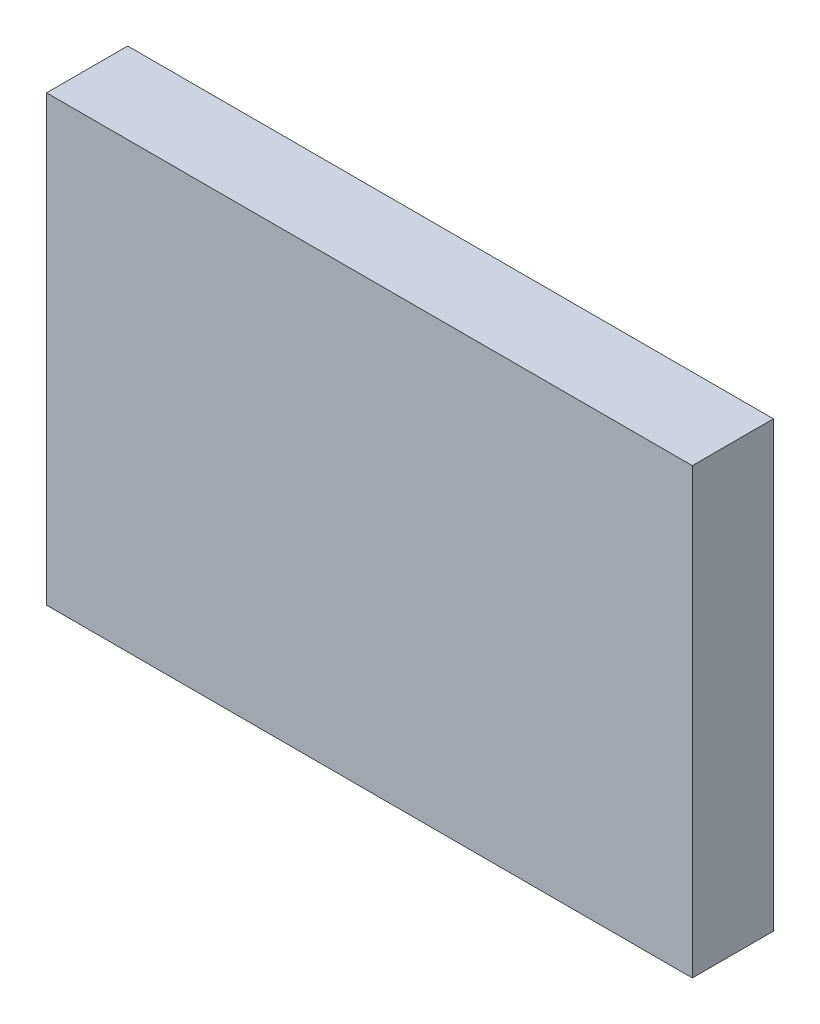
ISO-10303-21;
HEADER;
FILE_DESCRIPTION(('STEP AP214'),'2;1');
FILE_NAME('part.step','',(''),(''),'','','');
FILE_SCHEMA(('AUTOMOTIVE_DESIGN { 1 0 10303 214 1 1 1 1 }'));
ENDSEC;
DATA;
#1=APPLICATION_CONTEXT('core data for automotive mechanical design processes');
#2=APPLICATION_PROTOCOL_DEFINITION('international standard','automotive_design',2000,#1);
#3=PRODUCT_CONTEXT('',#1,'mechanical');
#4=PRODUCT('Part','Part','',(#3));
#5=PRODUCT_RELATED_PRODUCT_CATEGORY('part','',(#4));
#6=PRODUCT_DEFINITION_FORMATION('','',#4);
#7=PRODUCT_DEFINITION_CONTEXT('part definition',#1,'design');
#8=PRODUCT_DEFINITION('design','',#6,#7);
#9=PRODUCT_DEFINITION_SHAPE('','',#8);
#10=(LENGTH_UNIT() NAMED_UNIT(*) SI_UNIT(.MILLI.,.METRE.));
#11=(NAMED_UNIT(*) PLANE_ANGLE_UNIT() SI_UNIT($,.RADIAN.));
#12=(NAMED_UNIT(*) SI_UNIT($,.STERADIAN.) SOLID_ANGLE_UNIT());
#13=UNCERTAINTY_MEASURE_WITH_UNIT(LENGTH_MEASURE(1.E-05),#10,'distance_accuracy_value','');
#14=(GEOMETRIC_REPRESENTATION_CONTEXT(3) GLOBAL_UNCERTAINTY_ASSIGNED_CONTEXT((#13)) GLOBAL_UNIT_ASSIGNED_CONTEXT((#10,
#11,#12)) REPRESENTATION_CONTEXT('',''));
#15=CARTESIAN_POINT('',(0.,0.,0.));
#16=DIRECTION('',(0.,0.,1.));
#17=DIRECTION('',(1.,0.,0.));
#18=AXIS2_PLACEMENT_3D('',#15,#16,#17);
#19=CARTESIAN_POINT('',(-1.549,0.318,0.));
#20=DIRECTION('',(0.,-1.,0.));
#21=DIRECTION('',(0.,0.,-1.));
#22=AXIS2_PLACEMENT_3D('',#19,#20,#21);
#23=PLANE('',#22);
#24=DIRECTION('',(-1.,0.,0.));
#25=VECTOR('',#24,1.);
#26=CARTESIAN_POINT('',(-1.143,0.318,0.));
#27=LINE('',#26,#25);
#28=CARTESIAN_POINT('',(-1.143,0.318,0.));
#29=VERTEX_POINT('',#28);
#30=CARTESIAN_POINT('',(-1.549,0.318,0.));
#31=VERTEX_POINT('',#30);
#32=EDGE_CURVE('E11',#29,#31,#27,.T.);
#33=ORIENTED_EDGE('',*,*,#32,.F.);
#34=DIRECTION('',(0.,0.,-1.));
#35=VECTOR('',#34,1.);
#36=CARTESIAN_POINT('',(-1.143,0.318,0.051));
#37=LINE('',#36,#35);
#38=CARTESIAN_POINT('',(-1.143,0.318,0.051));
#39=VERTEX_POINT('',#38);
#40=EDGE_CURVE('E24',#39,#29,#37,.T.);
#41=ORIENTED_EDGE('',*,*,#40,.F.);
#42=DIRECTION('',(1.,0.,0.));
#43=VECTOR('',#42,1.);
#44=CARTESIAN_POINT('',(-1.549,0.318,0.051));
#45=LINE('',#44,#43);
#46=CARTESIAN_POINT('',(-1.549,0.318,0.051));
#47=VERTEX_POINT('',#46);
#48=EDGE_CURVE('E88',#47,#39,#45,.T.);
#49=ORIENTED_EDGE('',*,*,#48,.F.);
#50=DIRECTION('',(0.,0.,1.));
#51=VECTOR('',#50,1.);
#52=CARTESIAN_POINT('',(-1.549,0.318,0.));
#53=LINE('',#52,#51);
#54=EDGE_CURVE('E77',#31,#47,#53,.T.);
#55=ORIENTED_EDGE('',*,*,#54,.F.);
#56=EDGE_LOOP('',(#33,#41,#49,#55));
#57=FACE_BOUND('',#56,.T.);
#58=ADVANCED_FACE('F17',(#57),#23,.T.);
#59=CARTESIAN_POINT('',(-1.143,0.318,0.));
#60=DIRECTION('',(1.,0.,0.));
#61=DIRECTION('',(0.,1.,0.));
#62=AXIS2_PLACEMENT_3D('',#59,#60,#61);
#63=PLANE('',#62);
#64=DIRECTION('',(0.,-1.,0.));
#65=VECTOR('',#64,1.);
#66=CARTESIAN_POINT('',(-1.143,0.597,0.));
#67=LINE('',#66,#65);
#68=CARTESIAN_POINT('',(-1.143,0.597,0.));
#69=VERTEX_POINT('',#68);
#70=EDGE_CURVE('E85',#69,#29,#67,.T.);
#71=ORIENTED_EDGE('',*,*,#70,.F.);
#72=DIRECTION('',(0.,0.,-1.));
#73=VECTOR('',#72,1.);
#74=CARTESIAN_POINT('',(-1.143,0.597,0.051));
#75=LINE('',#74,#73);
#76=CARTESIAN_POINT('',(-1.143,0.597,0.051));
#77=VERTEX_POINT('',#76);
#78=EDGE_CURVE('E83',#77,#69,#75,.T.);
#79=ORIENTED_EDGE('',*,*,#78,.F.);
#80=DIRECTION('',(0.,1.,0.));
#81=VECTOR('',#80,1.);
#82=CARTESIAN_POINT('',(-1.143,0.318,0.051));
#83=LINE('',#82,#81);
#84=EDGE_CURVE('E72',#39,#77,#83,.T.);
#85=ORIENTED_EDGE('',*,*,#84,.F.);
#86=ORIENTED_EDGE('',*,*,#40,.T.);
#87=EDGE_LOOP('',(#71,#79,#85,#86));
#88=FACE_BOUND('',#87,.T.);
#89=ADVANCED_FACE('F90',(#88),#63,.T.);
#90=CARTESIAN_POINT('',(-1.143,0.597,0.));
#91=DIRECTION('',(0.,1.,0.));
#92=DIRECTION('',(1.,0.,0.));
#93=AXIS2_PLACEMENT_3D('',#90,#91,#92);
#94=PLANE('',#93);
#95=DIRECTION('',(1.,0.,0.));
#96=VECTOR('',#95,1.);
#97=CARTESIAN_POINT('',(-1.549,0.597,0.));
#98=LINE('',#97,#96);
#99=CARTESIAN_POINT('',(-1.549,0.597,0.));
#100=VERTEX_POINT('',#99);
#101=EDGE_CURVE('E60',#100,#69,#98,.T.);
#102=ORIENTED_EDGE('',*,*,#101,.F.);
#103=DIRECTION('',(0.,0.,-1.));
#104=VECTOR('',#103,1.);
#105=CARTESIAN_POINT('',(-1.549,0.597,0.051));
#106=LINE('',#105,#104);
#107=CARTESIAN_POINT('',(-1.549,0.597,0.051));
#108=VERTEX_POINT('',#107);
#109=EDGE_CURVE('E54',#108,#100,#106,.T.);
#110=ORIENTED_EDGE('',*,*,#109,.F.);
#111=DIRECTION('',(-1.,0.,0.));
#112=VECTOR('',#111,1.);
#113=CARTESIAN_POINT('',(-1.143,0.597,0.051));
#114=LINE('',#113,#112);
#115=EDGE_CURVE('E58',#77,#108,#114,.T.);
#116=ORIENTED_EDGE('',*,*,#115,.F.);
#117=ORIENTED_EDGE('',*,*,#78,.T.);
#118=EDGE_LOOP('',(#102,#110,#116,#117));
#119=FACE_BOUND('',#118,.T.);
#120=ADVANCED_FACE('F56',(#119),#94,.T.);
#121=CARTESIAN_POINT('',(-1.549,0.597,0.));
#122=DIRECTION('',(-1.,0.,0.));
#123=DIRECTION('',(0.,0.,1.));
#124=AXIS2_PLACEMENT_3D('',#121,#122,#123);
#125=PLANE('',#124);
#126=DIRECTION('',(0.,1.,0.));
#127=VECTOR('',#126,1.);
#128=CARTESIAN_POINT('',(-1.549,0.318,0.));
#129=LINE('',#128,#127);
#130=EDGE_CURVE('E73',#31,#100,#129,.T.);
#131=ORIENTED_EDGE('',*,*,#130,.F.);
#132=ORIENTED_EDGE('',*,*,#54,.T.);
#133=DIRECTION('',(0.,-1.,0.));
#134=VECTOR('',#133,1.);
#135=CARTESIAN_POINT('',(-1.549,0.597,0.051));
#136=LINE('',#135,#134);
#137=EDGE_CURVE('E70',#108,#47,#136,.T.);
#138=ORIENTED_EDGE('',*,*,#137,.F.);
#139=ORIENTED_EDGE('',*,*,#109,.T.);
#140=EDGE_LOOP('',(#131,#132,#138,#139));
#141=FACE_BOUND('',#140,.T.);
#142=ADVANCED_FACE('F76',(#141),#125,.T.);
#143=CARTESIAN_POINT('',(-1.549,0.597,0.));
#144=DIRECTION('',(0.,0.,-1.));
#145=DIRECTION('',(0.,-1.,0.));
#146=AXIS2_PLACEMENT_3D('',#143,#144,#145);
#147=PLANE('',#146);
#148=ORIENTED_EDGE('',*,*,#101,.T.);
#149=ORIENTED_EDGE('',*,*,#70,.T.);
#150=ORIENTED_EDGE('',*,*,#32,.T.);
#151=ORIENTED_EDGE('',*,*,#130,.T.);
#152=EDGE_LOOP('',(#148,#149,#150,#151));
#153=FACE_BOUND('',#152,.T.);
#154=ADVANCED_FACE('F91',(#153),#147,.T.);
#155=CARTESIAN_POINT('',(-1.549,0.318,0.051));
#156=DIRECTION('',(0.,0.,1.));
#157=DIRECTION('',(1.,0.,0.));
#158=AXIS2_PLACEMENT_3D('',#155,#156,#157);
#159=PLANE('',#158);
#160=ORIENTED_EDGE('',*,*,#48,.T.);
#161=ORIENTED_EDGE('',*,*,#84,.T.);
#162=ORIENTED_EDGE('',*,*,#115,.T.);
#163=ORIENTED_EDGE('',*,*,#137,.T.);
#164=EDGE_LOOP('',(#160,#161,#162,#163));
#165=FACE_BOUND('',#164,.T.);
#166=ADVANCED_FACE('F69',(#165),#159,.T.);
#167=CLOSED_SHELL('',(#58,#89,#120,#142,#154,#166));
#168=MANIFOLD_SOLID_BREP('B1',#167);
#169=ADVANCED_BREP_SHAPE_REPRESENTATION('',(#18,#168),#14);
#170=SHAPE_DEFINITION_REPRESENTATION(#9,#169);
ENDSEC;
END-ISO-10303-21;
